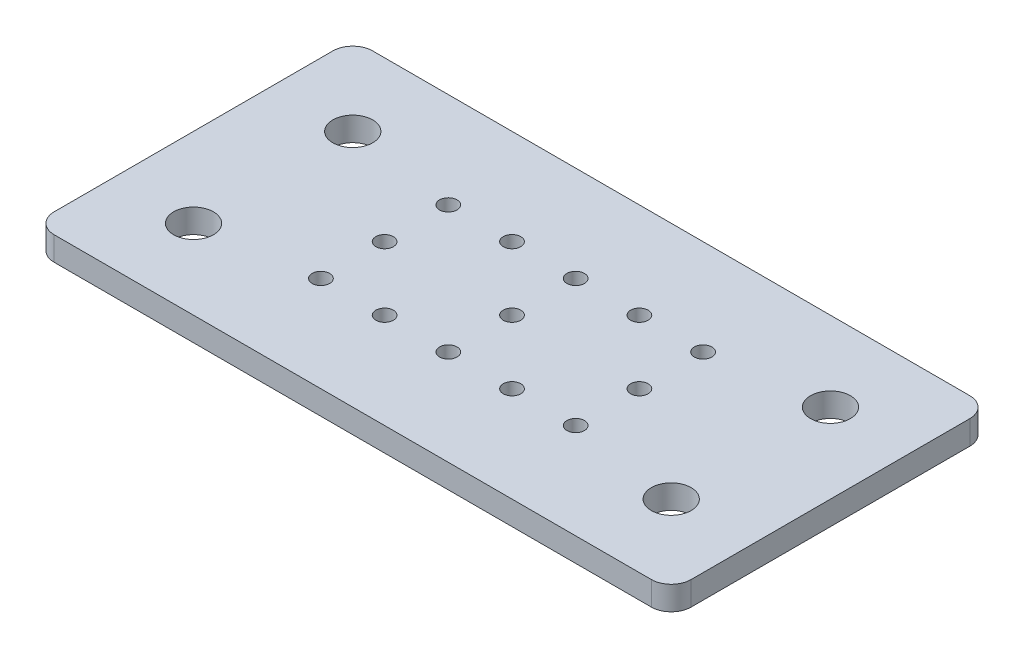
ISO-10303-21;
HEADER;
FILE_DESCRIPTION(('STEP AP214'),'2;1');
FILE_NAME('part.step','',(''),(''),'','','');
FILE_SCHEMA(('AUTOMOTIVE_DESIGN { 1 0 10303 214 1 1 1 1 }'));
ENDSEC;
DATA;
#1=APPLICATION_CONTEXT('core data for automotive mechanical design processes');
#2=APPLICATION_PROTOCOL_DEFINITION('international standard','automotive_design',2000,#1);
#3=PRODUCT_CONTEXT('',#1,'mechanical');
#4=PRODUCT('Part','Part','',(#3));
#5=PRODUCT_RELATED_PRODUCT_CATEGORY('part','',(#4));
#6=PRODUCT_DEFINITION_FORMATION('','',#4);
#7=PRODUCT_DEFINITION_CONTEXT('part definition',#1,'design');
#8=PRODUCT_DEFINITION('design','',#6,#7);
#9=PRODUCT_DEFINITION_SHAPE('','',#8);
#10=(LENGTH_UNIT() NAMED_UNIT(*) SI_UNIT(.MILLI.,.METRE.));
#11=(NAMED_UNIT(*) PLANE_ANGLE_UNIT() SI_UNIT($,.RADIAN.));
#12=(NAMED_UNIT(*) SI_UNIT($,.STERADIAN.) SOLID_ANGLE_UNIT());
#13=UNCERTAINTY_MEASURE_WITH_UNIT(LENGTH_MEASURE(1.E-05),#10,'distance_accuracy_value','');
#14=(GEOMETRIC_REPRESENTATION_CONTEXT(3) GLOBAL_UNCERTAINTY_ASSIGNED_CONTEXT((#13)) GLOBAL_UNIT_ASSIGNED_CONTEXT((#10,
#11,#12)) REPRESENTATION_CONTEXT('',''));
#15=CARTESIAN_POINT('',(0.,0.,0.));
#16=DIRECTION('',(0.,0.,1.));
#17=DIRECTION('',(1.,0.,0.));
#18=AXIS2_PLACEMENT_3D('',#15,#16,#17);
#19=CARTESIAN_POINT('',(0.,3.,-40.));
#20=DIRECTION('',(0.,-1.,0.));
#21=DIRECTION('',(0.,0.,-1.));
#22=AXIS2_PLACEMENT_3D('',#19,#20,#21);
#23=PLANE('',#22);
#24=CARTESIAN_POINT('',(24.,3.,-28.));
#25=DIRECTION('',(0.,1.,0.));
#26=DIRECTION('',(0.,0.,-1.));
#27=AXIS2_PLACEMENT_3D('',#24,#25,#26);
#28=CIRCLE('',#27,1.1);
#29=CARTESIAN_POINT('',(24.,3.,-29.1));
#30=VERTEX_POINT('',#29);
#31=EDGE_CURVE('E261',#30,#30,#28,.T.);
#32=ORIENTED_EDGE('',*,*,#31,.F.);
#33=EDGE_LOOP('',(#32));
#34=FACE_BOUND('',#33,.T.);
#35=CARTESIAN_POINT('',(32.,3.,-12.));
#36=DIRECTION('',(0.,1.,0.));
#37=DIRECTION('',(0.,0.,-1.));
#38=AXIS2_PLACEMENT_3D('',#35,#36,#37);
#39=CIRCLE('',#38,1.1);
#40=CARTESIAN_POINT('',(32.,3.,-13.1));
#41=VERTEX_POINT('',#40);
#42=EDGE_CURVE('E249',#41,#41,#39,.T.);
#43=ORIENTED_EDGE('',*,*,#42,.F.);
#44=EDGE_LOOP('',(#43));
#45=FACE_BOUND('',#44,.T.);
#46=CARTESIAN_POINT('',(56.,3.,-12.));
#47=DIRECTION('',(0.,1.,0.));
#48=DIRECTION('',(0.,0.,1.));
#49=AXIS2_PLACEMENT_3D('',#46,#47,#48);
#50=CIRCLE('',#49,1.1);
#51=CARTESIAN_POINT('',(56.,3.,-10.9));
#52=VERTEX_POINT('',#51);
#53=EDGE_CURVE('E237',#52,#52,#50,.T.);
#54=ORIENTED_EDGE('',*,*,#53,.F.);
#55=EDGE_LOOP('',(#54));
#56=FACE_BOUND('',#55,.T.);
#57=CARTESIAN_POINT('',(40.,3.,-12.));
#58=DIRECTION('',(0.,1.,0.));
#59=DIRECTION('',(0.,0.,1.));
#60=AXIS2_PLACEMENT_3D('',#57,#58,#59);
#61=CIRCLE('',#60,1.1);
#62=CARTESIAN_POINT('',(40.,3.,-10.9));
#63=VERTEX_POINT('',#62);
#64=EDGE_CURVE('E225',#63,#63,#61,.T.);
#65=ORIENTED_EDGE('',*,*,#64,.F.);
#66=EDGE_LOOP('',(#65));
#67=FACE_BOUND('',#66,.T.);
#68=CARTESIAN_POINT('',(40.,3.,-20.));
#69=DIRECTION('',(0.,1.,0.));
#70=DIRECTION('',(0.,0.,1.));
#71=AXIS2_PLACEMENT_3D('',#68,#69,#70);
#72=CIRCLE('',#71,1.1);
#73=CARTESIAN_POINT('',(40.,3.,-18.9));
#74=VERTEX_POINT('',#73);
#75=EDGE_CURVE('E213',#74,#74,#72,.T.);
#76=ORIENTED_EDGE('',*,*,#75,.F.);
#77=EDGE_LOOP('',(#76));
#78=FACE_BOUND('',#77,.T.);
#79=CARTESIAN_POINT('',(48.,3.,-28.));
#80=DIRECTION('',(0.,1.,0.));
#81=DIRECTION('',(0.,0.,1.));
#82=AXIS2_PLACEMENT_3D('',#79,#80,#81);
#83=CIRCLE('',#82,1.1);
#84=CARTESIAN_POINT('',(48.,3.,-26.9));
#85=VERTEX_POINT('',#84);
#86=EDGE_CURVE('E201',#85,#85,#83,.T.);
#87=ORIENTED_EDGE('',*,*,#86,.F.);
#88=EDGE_LOOP('',(#87));
#89=FACE_BOUND('',#88,.T.);
#90=CARTESIAN_POINT('',(9.99999999999999,3.,-30.));
#91=DIRECTION('',(0.,1.,0.));
#92=DIRECTION('',(0.,0.,-1.));
#93=AXIS2_PLACEMENT_3D('',#90,#91,#92);
#94=CIRCLE('',#93,2.5);
#95=CARTESIAN_POINT('',(9.99999999999999,3.,-32.5));
#96=VERTEX_POINT('',#95);
#97=EDGE_CURVE('E189',#96,#96,#94,.T.);
#98=ORIENTED_EDGE('',*,*,#97,.F.);
#99=EDGE_LOOP('',(#98));
#100=FACE_BOUND('',#99,.T.);
#101=CARTESIAN_POINT('',(70.,3.,-10.));
#102=DIRECTION('',(0.,1.,0.));
#103=DIRECTION('',(0.,0.,-1.));
#104=AXIS2_PLACEMENT_3D('',#101,#102,#103);
#105=CIRCLE('',#104,2.50000000000001);
#106=CARTESIAN_POINT('',(70.,3.,-12.5));
#107=VERTEX_POINT('',#106);
#108=EDGE_CURVE('E178',#107,#107,#105,.T.);
#109=ORIENTED_EDGE('',*,*,#108,.F.);
#110=EDGE_LOOP('',(#109));
#111=FACE_BOUND('',#110,.T.);
#112=DIRECTION('',(-1.,0.,0.));
#113=VECTOR('',#112,1.);
#114=CARTESIAN_POINT('',(0.,3.,-40.));
#115=LINE('',#114,#113);
#116=CARTESIAN_POINT('',(77.5,3.,-40.));
#117=VERTEX_POINT('',#116);
#118=CARTESIAN_POINT('',(2.49999999999999,3.,-40.));
#119=VERTEX_POINT('',#118);
#120=EDGE_CURVE('E133',#117,#119,#115,.T.);
#121=ORIENTED_EDGE('',*,*,#120,.T.);
#122=CARTESIAN_POINT('',(2.49999999999999,3.,-37.5));
#123=DIRECTION('',(0.,-1.,0.));
#124=DIRECTION('',(0.,0.,-1.));
#125=AXIS2_PLACEMENT_3D('',#122,#123,#124);
#126=CIRCLE('',#125,2.5);
#127=CARTESIAN_POINT('',(0.,3.,-37.5));
#128=VERTEX_POINT('',#127);
#129=EDGE_CURVE('E152',#119,#128,#126,.F.);
#130=ORIENTED_EDGE('',*,*,#129,.T.);
#131=DIRECTION('',(0.,0.,1.));
#132=VECTOR('',#131,1.);
#133=CARTESIAN_POINT('',(0.,3.,0.));
#134=LINE('',#133,#132);
#135=CARTESIAN_POINT('',(0.,3.,-2.5));
#136=VERTEX_POINT('',#135);
#137=EDGE_CURVE('E116',#128,#136,#134,.T.);
#138=ORIENTED_EDGE('',*,*,#137,.T.);
#139=CARTESIAN_POINT('',(2.5,3.,-2.5));
#140=DIRECTION('',(0.,-1.,0.));
#141=DIRECTION('',(0.,0.,-1.));
#142=AXIS2_PLACEMENT_3D('',#139,#140,#141);
#143=CIRCLE('',#142,2.5);
#144=CARTESIAN_POINT('',(2.5,3.,0.));
#145=VERTEX_POINT('',#144);
#146=EDGE_CURVE('E147',#136,#145,#143,.F.);
#147=ORIENTED_EDGE('',*,*,#146,.T.);
#148=DIRECTION('',(1.,0.,0.));
#149=VECTOR('',#148,1.);
#150=CARTESIAN_POINT('',(0.,3.,0.));
#151=LINE('',#150,#149);
#152=CARTESIAN_POINT('',(77.5,3.,0.));
#153=VERTEX_POINT('',#152);
#154=EDGE_CURVE('E163',#145,#153,#151,.T.);
#155=ORIENTED_EDGE('',*,*,#154,.T.);
#156=CARTESIAN_POINT('',(77.5,3.,-2.50000000000001));
#157=DIRECTION('',(0.,-1.,0.));
#158=DIRECTION('',(0.,0.,-1.));
#159=AXIS2_PLACEMENT_3D('',#156,#157,#158);
#160=CIRCLE('',#159,2.5);
#161=CARTESIAN_POINT('',(80.,3.,-2.50000000000001));
#162=VERTEX_POINT('',#161);
#163=EDGE_CURVE('E52',#153,#162,#160,.F.);
#164=ORIENTED_EDGE('',*,*,#163,.T.);
#165=DIRECTION('',(0.,0.,-1.));
#166=VECTOR('',#165,1.);
#167=CARTESIAN_POINT('',(80.,3.,0.));
#168=LINE('',#167,#166);
#169=CARTESIAN_POINT('',(80.,3.,-37.5));
#170=VERTEX_POINT('',#169);
#171=EDGE_CURVE('E171',#162,#170,#168,.T.);
#172=ORIENTED_EDGE('',*,*,#171,.T.);
#173=CARTESIAN_POINT('',(77.5,3.,-37.5));
#174=DIRECTION('',(0.,-1.,0.));
#175=DIRECTION('',(0.,0.,-1.));
#176=AXIS2_PLACEMENT_3D('',#173,#174,#175);
#177=CIRCLE('',#176,2.5);
#178=EDGE_CURVE('E150',#170,#117,#177,.F.);
#179=ORIENTED_EDGE('',*,*,#178,.T.);
#180=EDGE_LOOP('',(#121,#130,#138,#147,#155,#164,#172,#179));
#181=FACE_BOUND('',#180,.T.);
#182=CARTESIAN_POINT('',(10.,3.,-10.));
#183=DIRECTION('',(0.,1.,0.));
#184=DIRECTION('',(0.,0.,1.));
#185=AXIS2_PLACEMENT_3D('',#182,#183,#184);
#186=CIRCLE('',#185,2.5);
#187=CARTESIAN_POINT('',(10.,3.,-7.5));
#188=VERTEX_POINT('',#187);
#189=EDGE_CURVE('E124',#188,#188,#186,.T.);
#190=ORIENTED_EDGE('',*,*,#189,.F.);
#191=EDGE_LOOP('',(#190));
#192=FACE_BOUND('',#191,.T.);
#193=CARTESIAN_POINT('',(70.,3.,-30.));
#194=DIRECTION('',(0.,1.,0.));
#195=DIRECTION('',(0.,0.,1.));
#196=AXIS2_PLACEMENT_3D('',#193,#194,#195);
#197=CIRCLE('',#196,2.50000000000001);
#198=CARTESIAN_POINT('',(70.,3.,-27.5));
#199=VERTEX_POINT('',#198);
#200=EDGE_CURVE('E183',#199,#199,#197,.T.);
#201=ORIENTED_EDGE('',*,*,#200,.F.);
#202=EDGE_LOOP('',(#201));
#203=FACE_BOUND('',#202,.T.);
#204=CARTESIAN_POINT('',(40.,3.,-28.));
#205=DIRECTION('',(0.,1.,0.));
#206=DIRECTION('',(0.,0.,1.));
#207=AXIS2_PLACEMENT_3D('',#204,#205,#206);
#208=CIRCLE('',#207,1.1);
#209=CARTESIAN_POINT('',(40.,3.,-26.9));
#210=VERTEX_POINT('',#209);
#211=EDGE_CURVE('E195',#210,#210,#208,.T.);
#212=ORIENTED_EDGE('',*,*,#211,.F.);
#213=EDGE_LOOP('',(#212));
#214=FACE_BOUND('',#213,.T.);
#215=CARTESIAN_POINT('',(56.,3.,-28.));
#216=DIRECTION('',(0.,1.,0.));
#217=DIRECTION('',(0.,0.,1.));
#218=AXIS2_PLACEMENT_3D('',#215,#216,#217);
#219=CIRCLE('',#218,1.1);
#220=CARTESIAN_POINT('',(56.,3.,-26.9));
#221=VERTEX_POINT('',#220);
#222=EDGE_CURVE('E207',#221,#221,#219,.T.);
#223=ORIENTED_EDGE('',*,*,#222,.F.);
#224=EDGE_LOOP('',(#223));
#225=FACE_BOUND('',#224,.T.);
#226=CARTESIAN_POINT('',(56.,3.,-20.));
#227=DIRECTION('',(0.,1.,0.));
#228=DIRECTION('',(0.,0.,1.));
#229=AXIS2_PLACEMENT_3D('',#226,#227,#228);
#230=CIRCLE('',#229,1.1);
#231=CARTESIAN_POINT('',(56.,3.,-18.9));
#232=VERTEX_POINT('',#231);
#233=EDGE_CURVE('E219',#232,#232,#230,.T.);
#234=ORIENTED_EDGE('',*,*,#233,.F.);
#235=EDGE_LOOP('',(#234));
#236=FACE_BOUND('',#235,.T.);
#237=CARTESIAN_POINT('',(48.,3.,-12.));
#238=DIRECTION('',(0.,1.,0.));
#239=DIRECTION('',(0.,0.,1.));
#240=AXIS2_PLACEMENT_3D('',#237,#238,#239);
#241=CIRCLE('',#240,1.1);
#242=CARTESIAN_POINT('',(48.,3.,-10.9));
#243=VERTEX_POINT('',#242);
#244=EDGE_CURVE('E231',#243,#243,#241,.T.);
#245=ORIENTED_EDGE('',*,*,#244,.F.);
#246=EDGE_LOOP('',(#245));
#247=FACE_BOUND('',#246,.T.);
#248=CARTESIAN_POINT('',(24.,3.,-12.));
#249=DIRECTION('',(0.,1.,0.));
#250=DIRECTION('',(0.,0.,-1.));
#251=AXIS2_PLACEMENT_3D('',#248,#249,#250);
#252=CIRCLE('',#251,1.1);
#253=CARTESIAN_POINT('',(24.,3.,-13.1));
#254=VERTEX_POINT('',#253);
#255=EDGE_CURVE('E243',#254,#254,#252,.T.);
#256=ORIENTED_EDGE('',*,*,#255,.F.);
#257=EDGE_LOOP('',(#256));
#258=FACE_BOUND('',#257,.T.);
#259=CARTESIAN_POINT('',(24.,3.,-20.));
#260=DIRECTION('',(0.,1.,0.));
#261=DIRECTION('',(0.,0.,-1.));
#262=AXIS2_PLACEMENT_3D('',#259,#260,#261);
#263=CIRCLE('',#262,1.1);
#264=CARTESIAN_POINT('',(24.,3.,-21.1));
#265=VERTEX_POINT('',#264);
#266=EDGE_CURVE('E255',#265,#265,#263,.T.);
#267=ORIENTED_EDGE('',*,*,#266,.F.);
#268=EDGE_LOOP('',(#267));
#269=FACE_BOUND('',#268,.T.);
#270=CARTESIAN_POINT('',(32.,3.,-28.));
#271=DIRECTION('',(0.,1.,0.));
#272=DIRECTION('',(0.,0.,-1.));
#273=AXIS2_PLACEMENT_3D('',#270,#271,#272);
#274=CIRCLE('',#273,1.1);
#275=CARTESIAN_POINT('',(32.,3.,-29.1));
#276=VERTEX_POINT('',#275);
#277=EDGE_CURVE('E267',#276,#276,#274,.T.);
#278=ORIENTED_EDGE('',*,*,#277,.F.);
#279=EDGE_LOOP('',(#278));
#280=FACE_BOUND('',#279,.T.);
#281=ADVANCED_FACE('F30',(#34,#45,#56,#67,#78,#89,#100,#111,#181,#192,#203,#214,#225,#236,#247,
#258,#269,#280),#23,.F.);
#282=CARTESIAN_POINT('',(0.,0.,-40.));
#283=DIRECTION('',(0.,-1.,0.));
#284=DIRECTION('',(0.,0.,-1.));
#285=AXIS2_PLACEMENT_3D('',#282,#283,#284);
#286=PLANE('',#285);
#287=CARTESIAN_POINT('',(24.,0.,-28.));
#288=DIRECTION('',(0.,1.,0.));
#289=DIRECTION('',(0.,0.,-1.));
#290=AXIS2_PLACEMENT_3D('',#287,#288,#289);
#291=CIRCLE('',#290,1.1);
#292=CARTESIAN_POINT('',(24.,0.,-29.1));
#293=VERTEX_POINT('',#292);
#294=EDGE_CURVE('E264',#293,#293,#291,.T.);
#295=ORIENTED_EDGE('',*,*,#294,.T.);
#296=EDGE_LOOP('',(#295));
#297=FACE_BOUND('',#296,.T.);
#298=CARTESIAN_POINT('',(32.,0.,-12.));
#299=DIRECTION('',(0.,1.,0.));
#300=DIRECTION('',(0.,0.,-1.));
#301=AXIS2_PLACEMENT_3D('',#298,#299,#300);
#302=CIRCLE('',#301,1.1);
#303=CARTESIAN_POINT('',(32.,0.,-13.1));
#304=VERTEX_POINT('',#303);
#305=EDGE_CURVE('E252',#304,#304,#302,.T.);
#306=ORIENTED_EDGE('',*,*,#305,.T.);
#307=EDGE_LOOP('',(#306));
#308=FACE_BOUND('',#307,.T.);
#309=CARTESIAN_POINT('',(56.,0.,-12.));
#310=DIRECTION('',(0.,1.,0.));
#311=DIRECTION('',(0.,0.,1.));
#312=AXIS2_PLACEMENT_3D('',#309,#310,#311);
#313=CIRCLE('',#312,1.1);
#314=CARTESIAN_POINT('',(56.,0.,-10.9));
#315=VERTEX_POINT('',#314);
#316=EDGE_CURVE('E240',#315,#315,#313,.T.);
#317=ORIENTED_EDGE('',*,*,#316,.T.);
#318=EDGE_LOOP('',(#317));
#319=FACE_BOUND('',#318,.T.);
#320=CARTESIAN_POINT('',(40.,0.,-12.));
#321=DIRECTION('',(0.,1.,0.));
#322=DIRECTION('',(0.,0.,1.));
#323=AXIS2_PLACEMENT_3D('',#320,#321,#322);
#324=CIRCLE('',#323,1.1);
#325=CARTESIAN_POINT('',(40.,0.,-10.9));
#326=VERTEX_POINT('',#325);
#327=EDGE_CURVE('E228',#326,#326,#324,.T.);
#328=ORIENTED_EDGE('',*,*,#327,.T.);
#329=EDGE_LOOP('',(#328));
#330=FACE_BOUND('',#329,.T.);
#331=CARTESIAN_POINT('',(40.,0.,-20.));
#332=DIRECTION('',(0.,1.,0.));
#333=DIRECTION('',(0.,0.,1.));
#334=AXIS2_PLACEMENT_3D('',#331,#332,#333);
#335=CIRCLE('',#334,1.1);
#336=CARTESIAN_POINT('',(40.,0.,-18.9));
#337=VERTEX_POINT('',#336);
#338=EDGE_CURVE('E216',#337,#337,#335,.T.);
#339=ORIENTED_EDGE('',*,*,#338,.T.);
#340=EDGE_LOOP('',(#339));
#341=FACE_BOUND('',#340,.T.);
#342=CARTESIAN_POINT('',(48.,0.,-28.));
#343=DIRECTION('',(0.,1.,0.));
#344=DIRECTION('',(0.,0.,1.));
#345=AXIS2_PLACEMENT_3D('',#342,#343,#344);
#346=CIRCLE('',#345,1.1);
#347=CARTESIAN_POINT('',(48.,0.,-26.9));
#348=VERTEX_POINT('',#347);
#349=EDGE_CURVE('E204',#348,#348,#346,.T.);
#350=ORIENTED_EDGE('',*,*,#349,.T.);
#351=EDGE_LOOP('',(#350));
#352=FACE_BOUND('',#351,.T.);
#353=CARTESIAN_POINT('',(9.99999999999999,0.,-30.));
#354=DIRECTION('',(0.,1.,0.));
#355=DIRECTION('',(0.,0.,-1.));
#356=AXIS2_PLACEMENT_3D('',#353,#354,#355);
#357=CIRCLE('',#356,2.5);
#358=CARTESIAN_POINT('',(9.99999999999999,0.,-32.5));
#359=VERTEX_POINT('',#358);
#360=EDGE_CURVE('E192',#359,#359,#357,.T.);
#361=ORIENTED_EDGE('',*,*,#360,.T.);
#362=EDGE_LOOP('',(#361));
#363=FACE_BOUND('',#362,.T.);
#364=CARTESIAN_POINT('',(70.,0.,-10.));
#365=DIRECTION('',(0.,1.,0.));
#366=DIRECTION('',(0.,0.,-1.));
#367=AXIS2_PLACEMENT_3D('',#364,#365,#366);
#368=CIRCLE('',#367,2.50000000000001);
#369=CARTESIAN_POINT('',(70.,0.,-12.5));
#370=VERTEX_POINT('',#369);
#371=EDGE_CURVE('E180',#370,#370,#368,.T.);
#372=ORIENTED_EDGE('',*,*,#371,.T.);
#373=EDGE_LOOP('',(#372));
#374=FACE_BOUND('',#373,.T.);
#375=DIRECTION('',(0.,0.,1.));
#376=VECTOR('',#375,1.);
#377=CARTESIAN_POINT('',(0.,0.,0.));
#378=LINE('',#377,#376);
#379=CARTESIAN_POINT('',(0.,0.,-37.5));
#380=VERTEX_POINT('',#379);
#381=CARTESIAN_POINT('',(0.,0.,-2.5));
#382=VERTEX_POINT('',#381);
#383=EDGE_CURVE('E113',#380,#382,#378,.T.);
#384=ORIENTED_EDGE('',*,*,#383,.F.);
#385=CARTESIAN_POINT('',(2.49999999999999,0.,-37.5));
#386=DIRECTION('',(0.,-1.,0.));
#387=DIRECTION('',(0.,0.,-1.));
#388=AXIS2_PLACEMENT_3D('',#385,#386,#387);
#389=CIRCLE('',#388,2.5);
#390=CARTESIAN_POINT('',(2.49999999999999,0.,-40.));
#391=VERTEX_POINT('',#390);
#392=EDGE_CURVE('E96',#380,#391,#389,.T.);
#393=ORIENTED_EDGE('',*,*,#392,.T.);
#394=DIRECTION('',(-1.,0.,0.));
#395=VECTOR('',#394,1.);
#396=CARTESIAN_POINT('',(0.,0.,-40.));
#397=LINE('',#396,#395);
#398=CARTESIAN_POINT('',(77.5,0.,-40.));
#399=VERTEX_POINT('',#398);
#400=EDGE_CURVE('E137',#399,#391,#397,.T.);
#401=ORIENTED_EDGE('',*,*,#400,.F.);
#402=CARTESIAN_POINT('',(77.5,0.,-37.5));
#403=DIRECTION('',(0.,-1.,0.));
#404=DIRECTION('',(0.,0.,-1.));
#405=AXIS2_PLACEMENT_3D('',#402,#403,#404);
#406=CIRCLE('',#405,2.5);
#407=CARTESIAN_POINT('',(80.,0.,-37.5));
#408=VERTEX_POINT('',#407);
#409=EDGE_CURVE('E107',#399,#408,#406,.T.);
#410=ORIENTED_EDGE('',*,*,#409,.T.);
#411=DIRECTION('',(0.,0.,-1.));
#412=VECTOR('',#411,1.);
#413=CARTESIAN_POINT('',(80.,0.,0.));
#414=LINE('',#413,#412);
#415=CARTESIAN_POINT('',(80.,0.,-2.50000000000001));
#416=VERTEX_POINT('',#415);
#417=EDGE_CURVE('E127',#416,#408,#414,.T.);
#418=ORIENTED_EDGE('',*,*,#417,.F.);
#419=CARTESIAN_POINT('',(77.5,0.,-2.50000000000001));
#420=DIRECTION('',(0.,-1.,0.));
#421=DIRECTION('',(0.,0.,-1.));
#422=AXIS2_PLACEMENT_3D('',#419,#420,#421);
#423=CIRCLE('',#422,2.5);
#424=CARTESIAN_POINT('',(77.5,0.,0.));
#425=VERTEX_POINT('',#424);
#426=EDGE_CURVE('E141',#416,#425,#423,.T.);
#427=ORIENTED_EDGE('',*,*,#426,.T.);
#428=DIRECTION('',(1.,0.,0.));
#429=VECTOR('',#428,1.);
#430=CARTESIAN_POINT('',(0.,0.,0.));
#431=LINE('',#430,#429);
#432=CARTESIAN_POINT('',(2.5,0.,0.));
#433=VERTEX_POINT('',#432);
#434=EDGE_CURVE('E123',#433,#425,#431,.T.);
#435=ORIENTED_EDGE('',*,*,#434,.F.);
#436=CARTESIAN_POINT('',(2.5,0.,-2.5));
#437=DIRECTION('',(0.,-1.,0.));
#438=DIRECTION('',(0.,0.,-1.));
#439=AXIS2_PLACEMENT_3D('',#436,#437,#438);
#440=CIRCLE('',#439,2.5);
#441=EDGE_CURVE('E117',#433,#382,#440,.T.);
#442=ORIENTED_EDGE('',*,*,#441,.T.);
#443=EDGE_LOOP('',(#384,#393,#401,#410,#418,#427,#435,#442));
#444=FACE_BOUND('',#443,.T.);
#445=CARTESIAN_POINT('',(10.,0.,-10.));
#446=DIRECTION('',(0.,1.,0.));
#447=DIRECTION('',(0.,0.,1.));
#448=AXIS2_PLACEMENT_3D('',#445,#446,#447);
#449=CIRCLE('',#448,2.5);
#450=CARTESIAN_POINT('',(10.,0.,-7.5));
#451=VERTEX_POINT('',#450);
#452=EDGE_CURVE('E130',#451,#451,#449,.T.);
#453=ORIENTED_EDGE('',*,*,#452,.T.);
#454=EDGE_LOOP('',(#453));
#455=FACE_BOUND('',#454,.T.);
#456=CARTESIAN_POINT('',(70.,0.,-30.));
#457=DIRECTION('',(0.,1.,0.));
#458=DIRECTION('',(0.,0.,1.));
#459=AXIS2_PLACEMENT_3D('',#456,#457,#458);
#460=CIRCLE('',#459,2.50000000000001);
#461=CARTESIAN_POINT('',(70.,0.,-27.5));
#462=VERTEX_POINT('',#461);
#463=EDGE_CURVE('E186',#462,#462,#460,.T.);
#464=ORIENTED_EDGE('',*,*,#463,.T.);
#465=EDGE_LOOP('',(#464));
#466=FACE_BOUND('',#465,.T.);
#467=CARTESIAN_POINT('',(40.,0.,-28.));
#468=DIRECTION('',(0.,1.,0.));
#469=DIRECTION('',(0.,0.,1.));
#470=AXIS2_PLACEMENT_3D('',#467,#468,#469);
#471=CIRCLE('',#470,1.1);
#472=CARTESIAN_POINT('',(40.,0.,-26.9));
#473=VERTEX_POINT('',#472);
#474=EDGE_CURVE('E198',#473,#473,#471,.T.);
#475=ORIENTED_EDGE('',*,*,#474,.T.);
#476=EDGE_LOOP('',(#475));
#477=FACE_BOUND('',#476,.T.);
#478=CARTESIAN_POINT('',(56.,0.,-28.));
#479=DIRECTION('',(0.,1.,0.));
#480=DIRECTION('',(0.,0.,1.));
#481=AXIS2_PLACEMENT_3D('',#478,#479,#480);
#482=CIRCLE('',#481,1.1);
#483=CARTESIAN_POINT('',(56.,0.,-26.9));
#484=VERTEX_POINT('',#483);
#485=EDGE_CURVE('E210',#484,#484,#482,.T.);
#486=ORIENTED_EDGE('',*,*,#485,.T.);
#487=EDGE_LOOP('',(#486));
#488=FACE_BOUND('',#487,.T.);
#489=CARTESIAN_POINT('',(56.,0.,-20.));
#490=DIRECTION('',(0.,1.,0.));
#491=DIRECTION('',(0.,0.,1.));
#492=AXIS2_PLACEMENT_3D('',#489,#490,#491);
#493=CIRCLE('',#492,1.1);
#494=CARTESIAN_POINT('',(56.,0.,-18.9));
#495=VERTEX_POINT('',#494);
#496=EDGE_CURVE('E222',#495,#495,#493,.T.);
#497=ORIENTED_EDGE('',*,*,#496,.T.);
#498=EDGE_LOOP('',(#497));
#499=FACE_BOUND('',#498,.T.);
#500=CARTESIAN_POINT('',(48.,0.,-12.));
#501=DIRECTION('',(0.,1.,0.));
#502=DIRECTION('',(0.,0.,1.));
#503=AXIS2_PLACEMENT_3D('',#500,#501,#502);
#504=CIRCLE('',#503,1.1);
#505=CARTESIAN_POINT('',(48.,0.,-10.9));
#506=VERTEX_POINT('',#505);
#507=EDGE_CURVE('E234',#506,#506,#504,.T.);
#508=ORIENTED_EDGE('',*,*,#507,.T.);
#509=EDGE_LOOP('',(#508));
#510=FACE_BOUND('',#509,.T.);
#511=CARTESIAN_POINT('',(24.,0.,-12.));
#512=DIRECTION('',(0.,1.,0.));
#513=DIRECTION('',(0.,0.,-1.));
#514=AXIS2_PLACEMENT_3D('',#511,#512,#513);
#515=CIRCLE('',#514,1.1);
#516=CARTESIAN_POINT('',(24.,0.,-13.1));
#517=VERTEX_POINT('',#516);
#518=EDGE_CURVE('E246',#517,#517,#515,.T.);
#519=ORIENTED_EDGE('',*,*,#518,.T.);
#520=EDGE_LOOP('',(#519));
#521=FACE_BOUND('',#520,.T.);
#522=CARTESIAN_POINT('',(24.,0.,-20.));
#523=DIRECTION('',(0.,1.,0.));
#524=DIRECTION('',(0.,0.,-1.));
#525=AXIS2_PLACEMENT_3D('',#522,#523,#524);
#526=CIRCLE('',#525,1.1);
#527=CARTESIAN_POINT('',(24.,0.,-21.1));
#528=VERTEX_POINT('',#527);
#529=EDGE_CURVE('E258',#528,#528,#526,.T.);
#530=ORIENTED_EDGE('',*,*,#529,.T.);
#531=EDGE_LOOP('',(#530));
#532=FACE_BOUND('',#531,.T.);
#533=CARTESIAN_POINT('',(32.,0.,-28.));
#534=DIRECTION('',(0.,1.,0.));
#535=DIRECTION('',(0.,0.,-1.));
#536=AXIS2_PLACEMENT_3D('',#533,#534,#535);
#537=CIRCLE('',#536,1.1);
#538=CARTESIAN_POINT('',(32.,0.,-29.1));
#539=VERTEX_POINT('',#538);
#540=EDGE_CURVE('E270',#539,#539,#537,.T.);
#541=ORIENTED_EDGE('',*,*,#540,.T.);
#542=EDGE_LOOP('',(#541));
#543=FACE_BOUND('',#542,.T.);
#544=ADVANCED_FACE('F120',(#297,#308,#319,#330,#341,#352,#363,#374,#444,#455,#466,#477,#488,
#499,#510,#521,#532,#543),#286,.T.);
#545=CARTESIAN_POINT('',(0.,3.,0.));
#546=DIRECTION('',(1.,0.,0.));
#547=DIRECTION('',(0.,0.,-1.));
#548=AXIS2_PLACEMENT_3D('',#545,#546,#547);
#549=PLANE('',#548);
#550=ORIENTED_EDGE('',*,*,#137,.F.);
#551=DIRECTION('',(0.,-1.,0.));
#552=VECTOR('',#551,1.);
#553=CARTESIAN_POINT('',(0.,3.,-37.5));
#554=LINE('',#553,#552);
#555=EDGE_CURVE('E100',#128,#380,#554,.T.);
#556=ORIENTED_EDGE('',*,*,#555,.T.);
#557=ORIENTED_EDGE('',*,*,#383,.T.);
#558=DIRECTION('',(0.,-1.,0.));
#559=VECTOR('',#558,1.);
#560=CARTESIAN_POINT('',(0.,3.,-2.5));
#561=LINE('',#560,#559);
#562=EDGE_CURVE('E118',#382,#136,#561,.F.);
#563=ORIENTED_EDGE('',*,*,#562,.T.);
#564=EDGE_LOOP('',(#550,#556,#557,#563));
#565=FACE_BOUND('',#564,.T.);
#566=ADVANCED_FACE('F112',(#565),#549,.F.);
#567=CARTESIAN_POINT('',(0.,3.,0.));
#568=DIRECTION('',(0.,0.,-1.));
#569=DIRECTION('',(-1.,0.,0.));
#570=AXIS2_PLACEMENT_3D('',#567,#568,#569);
#571=PLANE('',#570);
#572=ORIENTED_EDGE('',*,*,#434,.T.);
#573=DIRECTION('',(0.,-1.,0.));
#574=VECTOR('',#573,1.);
#575=CARTESIAN_POINT('',(77.5,3.,0.));
#576=LINE('',#575,#574);
#577=EDGE_CURVE('E11',#425,#153,#576,.F.);
#578=ORIENTED_EDGE('',*,*,#577,.T.);
#579=ORIENTED_EDGE('',*,*,#154,.F.);
#580=DIRECTION('',(0.,-1.,0.));
#581=VECTOR('',#580,1.);
#582=CARTESIAN_POINT('',(2.5,3.,0.));
#583=LINE('',#582,#581);
#584=EDGE_CURVE('E38',#145,#433,#583,.T.);
#585=ORIENTED_EDGE('',*,*,#584,.T.);
#586=EDGE_LOOP('',(#572,#578,#579,#585));
#587=FACE_BOUND('',#586,.T.);
#588=ADVANCED_FACE('F161',(#587),#571,.F.);
#589=CARTESIAN_POINT('',(80.,3.,0.));
#590=DIRECTION('',(-1.,0.,0.));
#591=DIRECTION('',(0.,0.,1.));
#592=AXIS2_PLACEMENT_3D('',#589,#590,#591);
#593=PLANE('',#592);
#594=ORIENTED_EDGE('',*,*,#417,.T.);
#595=DIRECTION('',(0.,-1.,0.));
#596=VECTOR('',#595,1.);
#597=CARTESIAN_POINT('',(80.,3.,-37.5));
#598=LINE('',#597,#596);
#599=EDGE_CURVE('E45',#408,#170,#598,.F.);
#600=ORIENTED_EDGE('',*,*,#599,.T.);
#601=ORIENTED_EDGE('',*,*,#171,.F.);
#602=DIRECTION('',(0.,-1.,0.));
#603=VECTOR('',#602,1.);
#604=CARTESIAN_POINT('',(80.,3.,-2.50000000000001));
#605=LINE('',#604,#603);
#606=EDGE_CURVE('E154',#162,#416,#605,.T.);
#607=ORIENTED_EDGE('',*,*,#606,.T.);
#608=EDGE_LOOP('',(#594,#600,#601,#607));
#609=FACE_BOUND('',#608,.T.);
#610=ADVANCED_FACE('F170',(#609),#593,.F.);
#611=CARTESIAN_POINT('',(0.,3.,-40.));
#612=DIRECTION('',(0.,0.,1.));
#613=DIRECTION('',(1.,0.,0.));
#614=AXIS2_PLACEMENT_3D('',#611,#612,#613);
#615=PLANE('',#614);
#616=ORIENTED_EDGE('',*,*,#400,.T.);
#617=DIRECTION('',(0.,-1.,0.));
#618=VECTOR('',#617,1.);
#619=CARTESIAN_POINT('',(2.49999999999999,3.,-40.));
#620=LINE('',#619,#618);
#621=EDGE_CURVE('E101',#391,#119,#620,.F.);
#622=ORIENTED_EDGE('',*,*,#621,.T.);
#623=ORIENTED_EDGE('',*,*,#120,.F.);
#624=DIRECTION('',(0.,-1.,0.));
#625=VECTOR('',#624,1.);
#626=CARTESIAN_POINT('',(77.5,3.,-40.));
#627=LINE('',#626,#625);
#628=EDGE_CURVE('E106',#117,#399,#627,.T.);
#629=ORIENTED_EDGE('',*,*,#628,.T.);
#630=EDGE_LOOP('',(#616,#622,#623,#629));
#631=FACE_BOUND('',#630,.T.);
#632=ADVANCED_FACE('F293',(#631),#615,.F.);
#633=CARTESIAN_POINT('',(10.,3.,-10.));
#634=DIRECTION('',(0.,-1.,0.));
#635=DIRECTION('',(0.,0.,-1.));
#636=AXIS2_PLACEMENT_3D('',#633,#634,#635);
#637=CYLINDRICAL_SURFACE('',#636,2.5);
#638=ORIENTED_EDGE('',*,*,#189,.T.);
#639=EDGE_LOOP('',(#638));
#640=FACE_BOUND('',#639,.T.);
#641=ORIENTED_EDGE('',*,*,#452,.F.);
#642=EDGE_LOOP('',(#641));
#643=FACE_BOUND('',#642,.T.);
#644=ADVANCED_FACE('F290',(#640,#643),#637,.F.);
#645=CARTESIAN_POINT('',(70.,3.,-10.));
#646=DIRECTION('',(0.,-1.,0.));
#647=DIRECTION('',(0.,0.,-1.));
#648=AXIS2_PLACEMENT_3D('',#645,#646,#647);
#649=CYLINDRICAL_SURFACE('',#648,2.50000000000001);
#650=ORIENTED_EDGE('',*,*,#108,.T.);
#651=EDGE_LOOP('',(#650));
#652=FACE_BOUND('',#651,.T.);
#653=ORIENTED_EDGE('',*,*,#371,.F.);
#654=EDGE_LOOP('',(#653));
#655=FACE_BOUND('',#654,.T.);
#656=ADVANCED_FACE('F396',(#652,#655),#649,.F.);
#657=CARTESIAN_POINT('',(70.,3.,-30.));
#658=DIRECTION('',(0.,-1.,0.));
#659=DIRECTION('',(0.,0.,-1.));
#660=AXIS2_PLACEMENT_3D('',#657,#658,#659);
#661=CYLINDRICAL_SURFACE('',#660,2.50000000000001);
#662=ORIENTED_EDGE('',*,*,#200,.T.);
#663=EDGE_LOOP('',(#662));
#664=FACE_BOUND('',#663,.T.);
#665=ORIENTED_EDGE('',*,*,#463,.F.);
#666=EDGE_LOOP('',(#665));
#667=FACE_BOUND('',#666,.T.);
#668=ADVANCED_FACE('F393',(#664,#667),#661,.F.);
#669=CARTESIAN_POINT('',(9.99999999999999,3.,-30.));
#670=DIRECTION('',(0.,-1.,0.));
#671=DIRECTION('',(0.,0.,-1.));
#672=AXIS2_PLACEMENT_3D('',#669,#670,#671);
#673=CYLINDRICAL_SURFACE('',#672,2.5);
#674=ORIENTED_EDGE('',*,*,#97,.T.);
#675=EDGE_LOOP('',(#674));
#676=FACE_BOUND('',#675,.T.);
#677=ORIENTED_EDGE('',*,*,#360,.F.);
#678=EDGE_LOOP('',(#677));
#679=FACE_BOUND('',#678,.T.);
#680=ADVANCED_FACE('F389',(#676,#679),#673,.F.);
#681=CARTESIAN_POINT('',(40.,3.,-28.));
#682=DIRECTION('',(0.,-1.,0.));
#683=DIRECTION('',(0.,0.,-1.));
#684=AXIS2_PLACEMENT_3D('',#681,#682,#683);
#685=CYLINDRICAL_SURFACE('',#684,1.1);
#686=ORIENTED_EDGE('',*,*,#211,.T.);
#687=EDGE_LOOP('',(#686));
#688=FACE_BOUND('',#687,.T.);
#689=ORIENTED_EDGE('',*,*,#474,.F.);
#690=EDGE_LOOP('',(#689));
#691=FACE_BOUND('',#690,.T.);
#692=ADVANCED_FACE('F385',(#688,#691),#685,.F.);
#693=CARTESIAN_POINT('',(48.,3.,-28.));
#694=DIRECTION('',(0.,-1.,0.));
#695=DIRECTION('',(0.,0.,-1.));
#696=AXIS2_PLACEMENT_3D('',#693,#694,#695);
#697=CYLINDRICAL_SURFACE('',#696,1.1);
#698=ORIENTED_EDGE('',*,*,#86,.T.);
#699=EDGE_LOOP('',(#698));
#700=FACE_BOUND('',#699,.T.);
#701=ORIENTED_EDGE('',*,*,#349,.F.);
#702=EDGE_LOOP('',(#701));
#703=FACE_BOUND('',#702,.T.);
#704=ADVANCED_FACE('F381',(#700,#703),#697,.F.);
#705=CARTESIAN_POINT('',(56.,3.,-28.));
#706=DIRECTION('',(0.,-1.,0.));
#707=DIRECTION('',(0.,0.,-1.));
#708=AXIS2_PLACEMENT_3D('',#705,#706,#707);
#709=CYLINDRICAL_SURFACE('',#708,1.1);
#710=ORIENTED_EDGE('',*,*,#222,.T.);
#711=EDGE_LOOP('',(#710));
#712=FACE_BOUND('',#711,.T.);
#713=ORIENTED_EDGE('',*,*,#485,.F.);
#714=EDGE_LOOP('',(#713));
#715=FACE_BOUND('',#714,.T.);
#716=ADVANCED_FACE('F377',(#712,#715),#709,.F.);
#717=CARTESIAN_POINT('',(40.,3.,-20.));
#718=DIRECTION('',(0.,-1.,0.));
#719=DIRECTION('',(0.,0.,-1.));
#720=AXIS2_PLACEMENT_3D('',#717,#718,#719);
#721=CYLINDRICAL_SURFACE('',#720,1.1);
#722=ORIENTED_EDGE('',*,*,#75,.T.);
#723=EDGE_LOOP('',(#722));
#724=FACE_BOUND('',#723,.T.);
#725=ORIENTED_EDGE('',*,*,#338,.F.);
#726=EDGE_LOOP('',(#725));
#727=FACE_BOUND('',#726,.T.);
#728=ADVANCED_FACE('F373',(#724,#727),#721,.F.);
#729=CARTESIAN_POINT('',(56.,3.,-20.));
#730=DIRECTION('',(0.,-1.,0.));
#731=DIRECTION('',(0.,0.,-1.));
#732=AXIS2_PLACEMENT_3D('',#729,#730,#731);
#733=CYLINDRICAL_SURFACE('',#732,1.1);
#734=ORIENTED_EDGE('',*,*,#233,.T.);
#735=EDGE_LOOP('',(#734));
#736=FACE_BOUND('',#735,.T.);
#737=ORIENTED_EDGE('',*,*,#496,.F.);
#738=EDGE_LOOP('',(#737));
#739=FACE_BOUND('',#738,.T.);
#740=ADVANCED_FACE('F369',(#736,#739),#733,.F.);
#741=CARTESIAN_POINT('',(40.,3.,-12.));
#742=DIRECTION('',(0.,-1.,0.));
#743=DIRECTION('',(0.,0.,-1.));
#744=AXIS2_PLACEMENT_3D('',#741,#742,#743);
#745=CYLINDRICAL_SURFACE('',#744,1.1);
#746=ORIENTED_EDGE('',*,*,#64,.T.);
#747=EDGE_LOOP('',(#746));
#748=FACE_BOUND('',#747,.T.);
#749=ORIENTED_EDGE('',*,*,#327,.F.);
#750=EDGE_LOOP('',(#749));
#751=FACE_BOUND('',#750,.T.);
#752=ADVANCED_FACE('F365',(#748,#751),#745,.F.);
#753=CARTESIAN_POINT('',(48.,3.,-12.));
#754=DIRECTION('',(0.,-1.,0.));
#755=DIRECTION('',(0.,0.,-1.));
#756=AXIS2_PLACEMENT_3D('',#753,#754,#755);
#757=CYLINDRICAL_SURFACE('',#756,1.1);
#758=ORIENTED_EDGE('',*,*,#244,.T.);
#759=EDGE_LOOP('',(#758));
#760=FACE_BOUND('',#759,.T.);
#761=ORIENTED_EDGE('',*,*,#507,.F.);
#762=EDGE_LOOP('',(#761));
#763=FACE_BOUND('',#762,.T.);
#764=ADVANCED_FACE('F361',(#760,#763),#757,.F.);
#765=CARTESIAN_POINT('',(56.,3.,-12.));
#766=DIRECTION('',(0.,-1.,0.));
#767=DIRECTION('',(0.,0.,-1.));
#768=AXIS2_PLACEMENT_3D('',#765,#766,#767);
#769=CYLINDRICAL_SURFACE('',#768,1.1);
#770=ORIENTED_EDGE('',*,*,#53,.T.);
#771=EDGE_LOOP('',(#770));
#772=FACE_BOUND('',#771,.T.);
#773=ORIENTED_EDGE('',*,*,#316,.F.);
#774=EDGE_LOOP('',(#773));
#775=FACE_BOUND('',#774,.T.);
#776=ADVANCED_FACE('F357',(#772,#775),#769,.F.);
#777=CARTESIAN_POINT('',(24.,3.,-12.));
#778=DIRECTION('',(0.,-1.,0.));
#779=DIRECTION('',(0.,0.,-1.));
#780=AXIS2_PLACEMENT_3D('',#777,#778,#779);
#781=CYLINDRICAL_SURFACE('',#780,1.1);
#782=ORIENTED_EDGE('',*,*,#255,.T.);
#783=EDGE_LOOP('',(#782));
#784=FACE_BOUND('',#783,.T.);
#785=ORIENTED_EDGE('',*,*,#518,.F.);
#786=EDGE_LOOP('',(#785));
#787=FACE_BOUND('',#786,.T.);
#788=ADVANCED_FACE('F353',(#784,#787),#781,.F.);
#789=CARTESIAN_POINT('',(32.,3.,-12.));
#790=DIRECTION('',(0.,-1.,0.));
#791=DIRECTION('',(0.,0.,-1.));
#792=AXIS2_PLACEMENT_3D('',#789,#790,#791);
#793=CYLINDRICAL_SURFACE('',#792,1.1);
#794=ORIENTED_EDGE('',*,*,#42,.T.);
#795=EDGE_LOOP('',(#794));
#796=FACE_BOUND('',#795,.T.);
#797=ORIENTED_EDGE('',*,*,#305,.F.);
#798=EDGE_LOOP('',(#797));
#799=FACE_BOUND('',#798,.T.);
#800=ADVANCED_FACE('F337',(#796,#799),#793,.F.);
#801=CARTESIAN_POINT('',(24.,3.,-20.));
#802=DIRECTION('',(0.,-1.,0.));
#803=DIRECTION('',(0.,0.,-1.));
#804=AXIS2_PLACEMENT_3D('',#801,#802,#803);
#805=CYLINDRICAL_SURFACE('',#804,1.1);
#806=ORIENTED_EDGE('',*,*,#266,.T.);
#807=EDGE_LOOP('',(#806));
#808=FACE_BOUND('',#807,.T.);
#809=ORIENTED_EDGE('',*,*,#529,.F.);
#810=EDGE_LOOP('',(#809));
#811=FACE_BOUND('',#810,.T.);
#812=ADVANCED_FACE('F333',(#808,#811),#805,.F.);
#813=CARTESIAN_POINT('',(24.,3.,-28.));
#814=DIRECTION('',(0.,-1.,0.));
#815=DIRECTION('',(0.,0.,-1.));
#816=AXIS2_PLACEMENT_3D('',#813,#814,#815);
#817=CYLINDRICAL_SURFACE('',#816,1.1);
#818=ORIENTED_EDGE('',*,*,#31,.T.);
#819=EDGE_LOOP('',(#818));
#820=FACE_BOUND('',#819,.T.);
#821=ORIENTED_EDGE('',*,*,#294,.F.);
#822=EDGE_LOOP('',(#821));
#823=FACE_BOUND('',#822,.T.);
#824=ADVANCED_FACE('F336',(#820,#823),#817,.F.);
#825=CARTESIAN_POINT('',(32.,3.,-28.));
#826=DIRECTION('',(0.,-1.,0.));
#827=DIRECTION('',(0.,0.,-1.));
#828=AXIS2_PLACEMENT_3D('',#825,#826,#827);
#829=CYLINDRICAL_SURFACE('',#828,1.1);
#830=ORIENTED_EDGE('',*,*,#277,.T.);
#831=EDGE_LOOP('',(#830));
#832=FACE_BOUND('',#831,.T.);
#833=ORIENTED_EDGE('',*,*,#540,.F.);
#834=EDGE_LOOP('',(#833));
#835=FACE_BOUND('',#834,.T.);
#836=ADVANCED_FACE('F276',(#832,#835),#829,.F.);
#837=CARTESIAN_POINT('',(2.49999999999999,3.,-37.5));
#838=DIRECTION('',(0.,-1.,0.));
#839=DIRECTION('',(0.,0.,-1.));
#840=AXIS2_PLACEMENT_3D('',#837,#838,#839);
#841=CYLINDRICAL_SURFACE('',#840,2.5);
#842=ORIENTED_EDGE('',*,*,#129,.F.);
#843=ORIENTED_EDGE('',*,*,#621,.F.);
#844=ORIENTED_EDGE('',*,*,#392,.F.);
#845=ORIENTED_EDGE('',*,*,#555,.F.);
#846=EDGE_LOOP('',(#842,#843,#844,#845));
#847=FACE_BOUND('',#846,.T.);
#848=ADVANCED_FACE('F99',(#847),#841,.T.);
#849=CARTESIAN_POINT('',(77.5,3.,-37.5));
#850=DIRECTION('',(0.,-1.,0.));
#851=DIRECTION('',(0.,0.,-1.));
#852=AXIS2_PLACEMENT_3D('',#849,#850,#851);
#853=CYLINDRICAL_SURFACE('',#852,2.5);
#854=ORIENTED_EDGE('',*,*,#178,.F.);
#855=ORIENTED_EDGE('',*,*,#599,.F.);
#856=ORIENTED_EDGE('',*,*,#409,.F.);
#857=ORIENTED_EDGE('',*,*,#628,.F.);
#858=EDGE_LOOP('',(#854,#855,#856,#857));
#859=FACE_BOUND('',#858,.T.);
#860=ADVANCED_FACE('F305',(#859),#853,.T.);
#861=CARTESIAN_POINT('',(77.5,3.,-2.50000000000001));
#862=DIRECTION('',(0.,-1.,0.));
#863=DIRECTION('',(0.,0.,-1.));
#864=AXIS2_PLACEMENT_3D('',#861,#862,#863);
#865=CYLINDRICAL_SURFACE('',#864,2.5);
#866=ORIENTED_EDGE('',*,*,#163,.F.);
#867=ORIENTED_EDGE('',*,*,#577,.F.);
#868=ORIENTED_EDGE('',*,*,#426,.F.);
#869=ORIENTED_EDGE('',*,*,#606,.F.);
#870=EDGE_LOOP('',(#866,#867,#868,#869));
#871=FACE_BOUND('',#870,.T.);
#872=ADVANCED_FACE('F169',(#871),#865,.T.);
#873=CARTESIAN_POINT('',(2.5,3.,-2.5));
#874=DIRECTION('',(0.,-1.,0.));
#875=DIRECTION('',(0.,0.,-1.));
#876=AXIS2_PLACEMENT_3D('',#873,#874,#875);
#877=CYLINDRICAL_SURFACE('',#876,2.5);
#878=ORIENTED_EDGE('',*,*,#146,.F.);
#879=ORIENTED_EDGE('',*,*,#562,.F.);
#880=ORIENTED_EDGE('',*,*,#441,.F.);
#881=ORIENTED_EDGE('',*,*,#584,.F.);
#882=EDGE_LOOP('',(#878,#879,#880,#881));
#883=FACE_BOUND('',#882,.T.);
#884=ADVANCED_FACE('F32',(#883),#877,.T.);
#885=CLOSED_SHELL('',(#281,#544,#566,#588,#610,#632,#644,#656,#668,#680,#692,#704,#716,#728,
#740,#752,#764,#776,#788,#800,#812,#824,#836,#848,#860,#872,#884));
#886=MANIFOLD_SOLID_BREP('B2',#885);
#887=ADVANCED_BREP_SHAPE_REPRESENTATION('',(#18,#886),#14);
#888=SHAPE_DEFINITION_REPRESENTATION(#9,#887);
ENDSEC;
END-ISO-10303-21;
